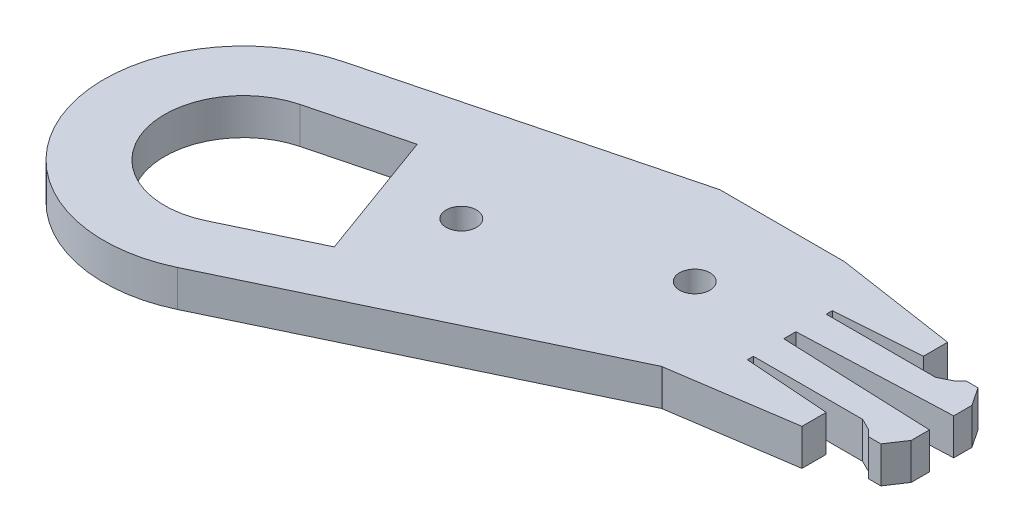
ISO-10303-21;
HEADER;
FILE_DESCRIPTION(('STEP AP214'),'2;1');
FILE_NAME('part.step','',(''),(''),'','','');
FILE_SCHEMA(('AUTOMOTIVE_DESIGN { 1 0 10303 214 1 1 1 1 }'));
ENDSEC;
DATA;
#1=APPLICATION_CONTEXT('core data for automotive mechanical design processes');
#2=APPLICATION_PROTOCOL_DEFINITION('international standard','automotive_design',2000,#1);
#3=PRODUCT_CONTEXT('',#1,'mechanical');
#4=PRODUCT('Part','Part','',(#3));
#5=PRODUCT_RELATED_PRODUCT_CATEGORY('part','',(#4));
#6=PRODUCT_DEFINITION_FORMATION('','',#4);
#7=PRODUCT_DEFINITION_CONTEXT('part definition',#1,'design');
#8=PRODUCT_DEFINITION('design','',#6,#7);
#9=PRODUCT_DEFINITION_SHAPE('','',#8);
#10=(LENGTH_UNIT() NAMED_UNIT(*) SI_UNIT(.MILLI.,.METRE.));
#11=(NAMED_UNIT(*) PLANE_ANGLE_UNIT() SI_UNIT($,.RADIAN.));
#12=(NAMED_UNIT(*) SI_UNIT($,.STERADIAN.) SOLID_ANGLE_UNIT());
#13=UNCERTAINTY_MEASURE_WITH_UNIT(LENGTH_MEASURE(1.E-05),#10,'distance_accuracy_value','');
#14=(GEOMETRIC_REPRESENTATION_CONTEXT(3) GLOBAL_UNCERTAINTY_ASSIGNED_CONTEXT((#13)) GLOBAL_UNIT_ASSIGNED_CONTEXT((#10,
#11,#12)) REPRESENTATION_CONTEXT('',''));
#15=CARTESIAN_POINT('',(0.,0.,0.));
#16=DIRECTION('',(0.,0.,1.));
#17=DIRECTION('',(1.,0.,0.));
#18=AXIS2_PLACEMENT_3D('',#15,#16,#17);
#19=CARTESIAN_POINT('',(-2.87937004662604,-3.,-11.1336978643482));
#20=DIRECTION('',(0.250380004054438,0.,0.968147640378109));
#21=DIRECTION('',(0.968147640378109,0.,-0.250380004054438));
#22=AXIS2_PLACEMENT_3D('',#19,#20,#21);
#23=PLANE('',#22);
#24=DIRECTION('',(0.968147640378109,0.,-0.250380004054438));
#25=VECTOR('',#24,1.);
#26=CARTESIAN_POINT('',(-2.87937004662604,0.,-11.1336978643482));
#27=LINE('',#26,#25);
#28=CARTESIAN_POINT('',(-2.87937004662604,0.,-11.1336978643482));
#29=VERTEX_POINT('',#28);
#30=CARTESIAN_POINT('',(21.7372937873807,0.,-17.5));
#31=VERTEX_POINT('',#30);
#32=EDGE_CURVE('E297',#29,#31,#27,.T.);
#33=ORIENTED_EDGE('',*,*,#32,.T.);
#34=DIRECTION('',(0.,1.,0.));
#35=VECTOR('',#34,1.);
#36=CARTESIAN_POINT('',(21.7372937873807,-3.,-17.5));
#37=LINE('',#36,#35);
#38=CARTESIAN_POINT('',(21.7372937873807,-3.,-17.5));
#39=VERTEX_POINT('',#38);
#40=EDGE_CURVE('E11',#39,#31,#37,.T.);
#41=ORIENTED_EDGE('',*,*,#40,.F.);
#42=DIRECTION('',(0.968147640378109,0.,-0.250380004054438));
#43=VECTOR('',#42,1.);
#44=CARTESIAN_POINT('',(-2.87937004662604,-3.,-11.1336978643482));
#45=LINE('',#44,#43);
#46=CARTESIAN_POINT('',(-2.87937004662604,-3.,-11.1336978643482));
#47=VERTEX_POINT('',#46);
#48=EDGE_CURVE('E54',#47,#39,#45,.T.);
#49=ORIENTED_EDGE('',*,*,#48,.F.);
#50=DIRECTION('',(0.,1.,0.));
#51=VECTOR('',#50,1.);
#52=CARTESIAN_POINT('',(-2.87937004662604,-3.,-11.1336978643482));
#53=LINE('',#52,#51);
#54=EDGE_CURVE('E432',#47,#29,#53,.T.);
#55=ORIENTED_EDGE('',*,*,#54,.T.);
#56=EDGE_LOOP('',(#33,#41,#49,#55));
#57=FACE_BOUND('',#56,.T.);
#58=ADVANCED_FACE('F35',(#57),#23,.F.);
#59=CARTESIAN_POINT('',(0.,-3.,-17.5));
#60=DIRECTION('',(0.,0.,-1.));
#61=DIRECTION('',(-1.,0.,0.));
#62=AXIS2_PLACEMENT_3D('',#59,#60,#61);
#63=PLANE('',#62);
#64=DIRECTION('',(-1.,0.,0.));
#65=VECTOR('',#64,1.);
#66=CARTESIAN_POINT('',(0.,0.,-17.5));
#67=LINE('',#66,#65);
#68=CARTESIAN_POINT('',(32.,0.,-17.5));
#69=VERTEX_POINT('',#68);
#70=EDGE_CURVE('E362',#69,#31,#67,.T.);
#71=ORIENTED_EDGE('',*,*,#70,.F.);
#72=DIRECTION('',(0.,1.,0.));
#73=VECTOR('',#72,1.);
#74=CARTESIAN_POINT('',(32.,-3.,-17.5));
#75=LINE('',#74,#73);
#76=CARTESIAN_POINT('',(32.,-3.,-17.5));
#77=VERTEX_POINT('',#76);
#78=EDGE_CURVE('E45',#77,#69,#75,.T.);
#79=ORIENTED_EDGE('',*,*,#78,.F.);
#80=DIRECTION('',(-1.,0.,0.));
#81=VECTOR('',#80,1.);
#82=CARTESIAN_POINT('',(0.,-3.,-17.5));
#83=LINE('',#82,#81);
#84=EDGE_CURVE('E270',#77,#39,#83,.T.);
#85=ORIENTED_EDGE('',*,*,#84,.T.);
#86=ORIENTED_EDGE('',*,*,#40,.T.);
#87=EDGE_LOOP('',(#71,#79,#85,#86));
#88=FACE_BOUND('',#87,.T.);
#89=ADVANCED_FACE('F621',(#88),#63,.T.);
#90=CARTESIAN_POINT('',(3.27139364303178,-3.,-21.8092909535452));
#91=DIRECTION('',(0.148340452930245,0.,-0.988936352868297));
#92=DIRECTION('',(-0.988936352868298,0.,-0.148340452930245));
#93=AXIS2_PLACEMENT_3D('',#90,#91,#92);
#94=PLANE('',#93);
#95=DIRECTION('',(-0.988936352868298,0.,-0.148340452930245));
#96=VECTOR('',#95,1.);
#97=CARTESIAN_POINT('',(3.27139364303178,0.,-21.8092909535452));
#98=LINE('',#97,#96);
#99=CARTESIAN_POINT('',(42.,0.,-16.));
#100=VERTEX_POINT('',#99);
#101=EDGE_CURVE('E257',#100,#69,#98,.T.);
#102=ORIENTED_EDGE('',*,*,#101,.F.);
#103=DIRECTION('',(0.,1.,0.));
#104=VECTOR('',#103,1.);
#105=CARTESIAN_POINT('',(42.,-3.,-16.));
#106=LINE('',#105,#104);
#107=CARTESIAN_POINT('',(42.,-3.,-16.));
#108=VERTEX_POINT('',#107);
#109=EDGE_CURVE('E253',#108,#100,#106,.T.);
#110=ORIENTED_EDGE('',*,*,#109,.F.);
#111=DIRECTION('',(-0.988936352868298,0.,-0.148340452930245));
#112=VECTOR('',#111,1.);
#113=CARTESIAN_POINT('',(3.27139364303178,-3.,-21.8092909535452));
#114=LINE('',#113,#112);
#115=EDGE_CURVE('E256',#108,#77,#114,.T.);
#116=ORIENTED_EDGE('',*,*,#115,.T.);
#117=ORIENTED_EDGE('',*,*,#78,.T.);
#118=EDGE_LOOP('',(#102,#110,#116,#117));
#119=FACE_BOUND('',#118,.T.);
#120=ADVANCED_FACE('F255',(#119),#94,.T.);
#121=CARTESIAN_POINT('',(42.,-3.,0.));
#122=DIRECTION('',(1.,0.,0.));
#123=DIRECTION('',(0.,0.,-1.));
#124=AXIS2_PLACEMENT_3D('',#121,#122,#123);
#125=PLANE('',#124);
#126=DIRECTION('',(0.,0.,-1.));
#127=VECTOR('',#126,1.);
#128=CARTESIAN_POINT('',(42.,0.,0.));
#129=LINE('',#128,#127);
#130=CARTESIAN_POINT('',(42.,0.,-14.));
#131=VERTEX_POINT('',#130);
#132=EDGE_CURVE('E359',#131,#100,#129,.T.);
#133=ORIENTED_EDGE('',*,*,#132,.F.);
#134=DIRECTION('',(0.,1.,0.));
#135=VECTOR('',#134,1.);
#136=CARTESIAN_POINT('',(42.,-3.,-14.));
#137=LINE('',#136,#135);
#138=CARTESIAN_POINT('',(42.,-3.,-14.));
#139=VERTEX_POINT('',#138);
#140=EDGE_CURVE('E262',#139,#131,#137,.T.);
#141=ORIENTED_EDGE('',*,*,#140,.F.);
#142=DIRECTION('',(0.,0.,-1.));
#143=VECTOR('',#142,1.);
#144=CARTESIAN_POINT('',(42.,-3.,0.));
#145=LINE('',#144,#143);
#146=EDGE_CURVE('E268',#139,#108,#145,.T.);
#147=ORIENTED_EDGE('',*,*,#146,.T.);
#148=ORIENTED_EDGE('',*,*,#109,.T.);
#149=EDGE_LOOP('',(#133,#141,#147,#148));
#150=FACE_BOUND('',#149,.T.);
#151=ADVANCED_FACE('F272',(#150),#125,.T.);
#152=CARTESIAN_POINT('',(-0.781725888324872,-3.,-10.9441624365482));
#153=DIRECTION('',(0.0712470499879095,0.,0.997458699830735));
#154=DIRECTION('',(0.997458699830735,0.,-0.0712470499879095));
#155=AXIS2_PLACEMENT_3D('',#152,#153,#154);
#156=PLANE('',#155);
#157=DIRECTION('',(0.997458699830735,0.,-0.0712470499879095));
#158=VECTOR('',#157,1.);
#159=CARTESIAN_POINT('',(-0.781725888324872,0.,-10.9441624365482));
#160=LINE('',#159,#158);
#161=CARTESIAN_POINT('',(35.,0.,-13.5));
#162=VERTEX_POINT('',#161);
#163=EDGE_CURVE('E356',#162,#131,#160,.T.);
#164=ORIENTED_EDGE('',*,*,#163,.F.);
#165=DIRECTION('',(0.,1.,0.));
#166=VECTOR('',#165,1.);
#167=CARTESIAN_POINT('',(35.,-3.,-13.5));
#168=LINE('',#167,#166);
#169=CARTESIAN_POINT('',(35.,-3.,-13.5));
#170=VERTEX_POINT('',#169);
#171=EDGE_CURVE('E374',#170,#162,#168,.T.);
#172=ORIENTED_EDGE('',*,*,#171,.F.);
#173=DIRECTION('',(0.997458699830735,0.,-0.0712470499879095));
#174=VECTOR('',#173,1.);
#175=CARTESIAN_POINT('',(-0.781725888324872,-3.,-10.9441624365482));
#176=LINE('',#175,#174);
#177=EDGE_CURVE('E273',#170,#139,#176,.T.);
#178=ORIENTED_EDGE('',*,*,#177,.T.);
#179=ORIENTED_EDGE('',*,*,#140,.T.);
#180=EDGE_LOOP('',(#164,#172,#178,#179));
#181=FACE_BOUND('',#180,.T.);
#182=ADVANCED_FACE('F624',(#181),#156,.T.);
#183=CARTESIAN_POINT('',(35.,-3.,0.));
#184=DIRECTION('',(1.,0.,0.));
#185=DIRECTION('',(0.,0.,-1.));
#186=AXIS2_PLACEMENT_3D('',#183,#184,#185);
#187=PLANE('',#186);
#188=DIRECTION('',(0.,0.,-1.));
#189=VECTOR('',#188,1.);
#190=CARTESIAN_POINT('',(35.,0.,0.));
#191=LINE('',#190,#189);
#192=CARTESIAN_POINT('',(35.,0.,-13.));
#193=VERTEX_POINT('',#192);
#194=EDGE_CURVE('E353',#193,#162,#191,.T.);
#195=ORIENTED_EDGE('',*,*,#194,.F.);
#196=DIRECTION('',(0.,1.,0.));
#197=VECTOR('',#196,1.);
#198=CARTESIAN_POINT('',(35.,-3.,-13.));
#199=LINE('',#198,#197);
#200=CARTESIAN_POINT('',(35.,-3.,-13.));
#201=VERTEX_POINT('',#200);
#202=EDGE_CURVE('E376',#201,#193,#199,.T.);
#203=ORIENTED_EDGE('',*,*,#202,.F.);
#204=DIRECTION('',(0.,0.,-1.));
#205=VECTOR('',#204,1.);
#206=CARTESIAN_POINT('',(35.,-3.,0.));
#207=LINE('',#206,#205);
#208=EDGE_CURVE('E275',#201,#170,#207,.T.);
#209=ORIENTED_EDGE('',*,*,#208,.T.);
#210=ORIENTED_EDGE('',*,*,#171,.T.);
#211=EDGE_LOOP('',(#195,#203,#209,#210));
#212=FACE_BOUND('',#211,.T.);
#213=ADVANCED_FACE('F518',(#212),#187,.T.);
#214=CARTESIAN_POINT('',(0.,-3.,-13.));
#215=DIRECTION('',(0.,0.,-1.));
#216=DIRECTION('',(-1.,0.,0.));
#217=AXIS2_PLACEMENT_3D('',#214,#215,#216);
#218=PLANE('',#217);
#219=DIRECTION('',(-1.,0.,0.));
#220=VECTOR('',#219,1.);
#221=CARTESIAN_POINT('',(0.,0.,-13.));
#222=LINE('',#221,#220);
#223=CARTESIAN_POINT('',(44.,0.,-13.));
#224=VERTEX_POINT('',#223);
#225=EDGE_CURVE('E350',#224,#193,#222,.T.);
#226=ORIENTED_EDGE('',*,*,#225,.F.);
#227=DIRECTION('',(0.,1.,0.));
#228=VECTOR('',#227,1.);
#229=CARTESIAN_POINT('',(44.,-3.,-13.));
#230=LINE('',#229,#228);
#231=CARTESIAN_POINT('',(44.,-3.,-13.));
#232=VERTEX_POINT('',#231);
#233=EDGE_CURVE('E378',#232,#224,#230,.T.);
#234=ORIENTED_EDGE('',*,*,#233,.F.);
#235=DIRECTION('',(-1.,0.,0.));
#236=VECTOR('',#235,1.);
#237=CARTESIAN_POINT('',(0.,-3.,-13.));
#238=LINE('',#237,#236);
#239=EDGE_CURVE('E512',#232,#201,#238,.T.);
#240=ORIENTED_EDGE('',*,*,#239,.T.);
#241=ORIENTED_EDGE('',*,*,#202,.T.);
#242=EDGE_LOOP('',(#226,#234,#240,#241));
#243=FACE_BOUND('',#242,.T.);
#244=ADVANCED_FACE('F524',(#243),#218,.T.);
#245=CARTESIAN_POINT('',(3.6,-3.,7.2));
#246=DIRECTION('',(-0.447213595499958,0.,-0.894427190999916));
#247=DIRECTION('',(-0.894427190999916,0.,0.447213595499958));
#248=AXIS2_PLACEMENT_3D('',#245,#246,#247);
#249=PLANE('',#248);
#250=DIRECTION('',(-0.894427190999916,0.,0.447213595499958));
#251=VECTOR('',#250,1.);
#252=CARTESIAN_POINT('',(3.6,0.,7.2));
#253=LINE('',#252,#251);
#254=CARTESIAN_POINT('',(45.,0.,-13.5));
#255=VERTEX_POINT('',#254);
#256=EDGE_CURVE('E347',#255,#224,#253,.T.);
#257=ORIENTED_EDGE('',*,*,#256,.F.);
#258=DIRECTION('',(0.,1.,0.));
#259=VECTOR('',#258,1.);
#260=CARTESIAN_POINT('',(45.,-3.,-13.5));
#261=LINE('',#260,#259);
#262=CARTESIAN_POINT('',(45.,-3.,-13.5));
#263=VERTEX_POINT('',#262);
#264=EDGE_CURVE('E380',#263,#255,#261,.T.);
#265=ORIENTED_EDGE('',*,*,#264,.F.);
#266=DIRECTION('',(-0.894427190999916,0.,0.447213595499958));
#267=VECTOR('',#266,1.);
#268=CARTESIAN_POINT('',(3.6,-3.,7.2));
#269=LINE('',#268,#267);
#270=EDGE_CURVE('E509',#263,#232,#269,.T.);
#271=ORIENTED_EDGE('',*,*,#270,.T.);
#272=ORIENTED_EDGE('',*,*,#233,.T.);
#273=EDGE_LOOP('',(#257,#265,#271,#272));
#274=FACE_BOUND('',#273,.T.);
#275=ADVANCED_FACE('F527',(#274),#249,.T.);
#276=CARTESIAN_POINT('',(15.75,-3.,15.75));
#277=DIRECTION('',(-0.707106781186547,0.,-0.707106781186547));
#278=DIRECTION('',(-0.707106781186548,0.,0.707106781186548));
#279=AXIS2_PLACEMENT_3D('',#276,#277,#278);
#280=PLANE('',#279);
#281=DIRECTION('',(-0.707106781186548,0.,0.707106781186548));
#282=VECTOR('',#281,1.);
#283=CARTESIAN_POINT('',(15.75,0.,15.75));
#284=LINE('',#283,#282);
#285=CARTESIAN_POINT('',(45.5,0.,-14.));
#286=VERTEX_POINT('',#285);
#287=EDGE_CURVE('E344',#286,#255,#284,.T.);
#288=ORIENTED_EDGE('',*,*,#287,.F.);
#289=DIRECTION('',(0.,1.,0.));
#290=VECTOR('',#289,1.);
#291=CARTESIAN_POINT('',(45.5,-3.,-14.));
#292=LINE('',#291,#290);
#293=CARTESIAN_POINT('',(45.5,-3.,-14.));
#294=VERTEX_POINT('',#293);
#295=EDGE_CURVE('E382',#294,#286,#292,.T.);
#296=ORIENTED_EDGE('',*,*,#295,.F.);
#297=DIRECTION('',(-0.707106781186548,0.,0.707106781186548));
#298=VECTOR('',#297,1.);
#299=CARTESIAN_POINT('',(15.75,-3.,15.75));
#300=LINE('',#299,#298);
#301=EDGE_CURVE('E506',#294,#263,#300,.T.);
#302=ORIENTED_EDGE('',*,*,#301,.T.);
#303=ORIENTED_EDGE('',*,*,#264,.T.);
#304=EDGE_LOOP('',(#288,#296,#302,#303));
#305=FACE_BOUND('',#304,.T.);
#306=ADVANCED_FACE('F532',(#305),#280,.T.);
#307=CARTESIAN_POINT('',(0.,-3.,-14.));
#308=DIRECTION('',(0.,0.,-1.));
#309=DIRECTION('',(-1.,0.,0.));
#310=AXIS2_PLACEMENT_3D('',#307,#308,#309);
#311=PLANE('',#310);
#312=DIRECTION('',(-1.,0.,0.));
#313=VECTOR('',#312,1.);
#314=CARTESIAN_POINT('',(0.,0.,-14.));
#315=LINE('',#314,#313);
#316=CARTESIAN_POINT('',(46.5,0.,-14.));
#317=VERTEX_POINT('',#316);
#318=EDGE_CURVE('E341',#317,#286,#315,.T.);
#319=ORIENTED_EDGE('',*,*,#318,.F.);
#320=DIRECTION('',(0.,1.,0.));
#321=VECTOR('',#320,1.);
#322=CARTESIAN_POINT('',(46.5,-3.,-14.));
#323=LINE('',#322,#321);
#324=CARTESIAN_POINT('',(46.5,-3.,-14.));
#325=VERTEX_POINT('',#324);
#326=EDGE_CURVE('E384',#325,#317,#323,.T.);
#327=ORIENTED_EDGE('',*,*,#326,.F.);
#328=DIRECTION('',(-1.,0.,0.));
#329=VECTOR('',#328,1.);
#330=CARTESIAN_POINT('',(0.,-3.,-14.));
#331=LINE('',#330,#329);
#332=EDGE_CURVE('E503',#325,#294,#331,.T.);
#333=ORIENTED_EDGE('',*,*,#332,.T.);
#334=ORIENTED_EDGE('',*,*,#295,.T.);
#335=EDGE_LOOP('',(#319,#327,#333,#334));
#336=FACE_BOUND('',#335,.T.);
#337=ADVANCED_FACE('F535',(#336),#311,.T.);
#338=CARTESIAN_POINT('',(38.6538461538461,-3.,-25.7692307692308));
#339=DIRECTION('',(0.832050294337843,0.,-0.554700196225229));
#340=DIRECTION('',(-0.55470019622523,0.,-0.832050294337843));
#341=AXIS2_PLACEMENT_3D('',#338,#339,#340);
#342=PLANE('',#341);
#343=DIRECTION('',(-0.55470019622523,0.,-0.832050294337843));
#344=VECTOR('',#343,1.);
#345=CARTESIAN_POINT('',(38.6538461538461,0.,-25.7692307692308));
#346=LINE('',#345,#344);
#347=CARTESIAN_POINT('',(47.5,0.,-12.5));
#348=VERTEX_POINT('',#347);
#349=EDGE_CURVE('E338',#348,#317,#346,.T.);
#350=ORIENTED_EDGE('',*,*,#349,.F.);
#351=DIRECTION('',(0.,1.,0.));
#352=VECTOR('',#351,1.);
#353=CARTESIAN_POINT('',(47.5,-3.,-12.5));
#354=LINE('',#353,#352);
#355=CARTESIAN_POINT('',(47.5,-3.,-12.5));
#356=VERTEX_POINT('',#355);
#357=EDGE_CURVE('E386',#356,#348,#354,.T.);
#358=ORIENTED_EDGE('',*,*,#357,.F.);
#359=DIRECTION('',(-0.55470019622523,0.,-0.832050294337843));
#360=VECTOR('',#359,1.);
#361=CARTESIAN_POINT('',(38.6538461538461,-3.,-25.7692307692308));
#362=LINE('',#361,#360);
#363=EDGE_CURVE('E500',#356,#325,#362,.T.);
#364=ORIENTED_EDGE('',*,*,#363,.T.);
#365=ORIENTED_EDGE('',*,*,#326,.T.);
#366=EDGE_LOOP('',(#350,#358,#364,#365));
#367=FACE_BOUND('',#366,.T.);
#368=ADVANCED_FACE('F540',(#367),#342,.T.);
#369=CARTESIAN_POINT('',(47.5,-3.,0.));
#370=DIRECTION('',(1.,0.,0.));
#371=DIRECTION('',(0.,0.,-1.));
#372=AXIS2_PLACEMENT_3D('',#369,#370,#371);
#373=PLANE('',#372);
#374=DIRECTION('',(0.,0.,-1.));
#375=VECTOR('',#374,1.);
#376=CARTESIAN_POINT('',(47.5,0.,0.));
#377=LINE('',#376,#375);
#378=CARTESIAN_POINT('',(47.5,0.,-11.));
#379=VERTEX_POINT('',#378);
#380=EDGE_CURVE('E335',#379,#348,#377,.T.);
#381=ORIENTED_EDGE('',*,*,#380,.F.);
#382=DIRECTION('',(0.,1.,0.));
#383=VECTOR('',#382,1.);
#384=CARTESIAN_POINT('',(47.5,-3.,-11.));
#385=LINE('',#384,#383);
#386=CARTESIAN_POINT('',(47.5,-3.,-11.));
#387=VERTEX_POINT('',#386);
#388=EDGE_CURVE('E388',#387,#379,#385,.T.);
#389=ORIENTED_EDGE('',*,*,#388,.F.);
#390=DIRECTION('',(0.,0.,-1.));
#391=VECTOR('',#390,1.);
#392=CARTESIAN_POINT('',(47.5,-3.,0.));
#393=LINE('',#392,#391);
#394=EDGE_CURVE('E497',#387,#356,#393,.T.);
#395=ORIENTED_EDGE('',*,*,#394,.T.);
#396=ORIENTED_EDGE('',*,*,#357,.T.);
#397=EDGE_LOOP('',(#381,#389,#395,#396));
#398=FACE_BOUND('',#397,.T.);
#399=ADVANCED_FACE('F543',(#398),#373,.T.);
#400=CARTESIAN_POINT('',(-0.363418530351438,-3.,-9.08546325878594));
#401=DIRECTION('',(0.0399680383488716,0.,0.999200958721789));
#402=DIRECTION('',(0.99920095872179,0.,-0.0399680383488716));
#403=AXIS2_PLACEMENT_3D('',#400,#401,#402);
#404=PLANE('',#403);
#405=DIRECTION('',(0.99920095872179,0.,-0.0399680383488716));
#406=VECTOR('',#405,1.);
#407=CARTESIAN_POINT('',(-0.363418530351438,0.,-9.08546325878594));
#408=LINE('',#407,#406);
#409=CARTESIAN_POINT('',(35.,0.,-10.5));
#410=VERTEX_POINT('',#409);
#411=EDGE_CURVE('E332',#410,#379,#408,.T.);
#412=ORIENTED_EDGE('',*,*,#411,.F.);
#413=DIRECTION('',(0.,1.,0.));
#414=VECTOR('',#413,1.);
#415=CARTESIAN_POINT('',(35.,-3.,-10.5));
#416=LINE('',#415,#414);
#417=CARTESIAN_POINT('',(35.,-3.,-10.5));
#418=VERTEX_POINT('',#417);
#419=EDGE_CURVE('E390',#418,#410,#416,.T.);
#420=ORIENTED_EDGE('',*,*,#419,.F.);
#421=DIRECTION('',(0.99920095872179,0.,-0.0399680383488716));
#422=VECTOR('',#421,1.);
#423=CARTESIAN_POINT('',(-0.363418530351438,-3.,-9.08546325878594));
#424=LINE('',#423,#422);
#425=EDGE_CURVE('E494',#418,#387,#424,.T.);
#426=ORIENTED_EDGE('',*,*,#425,.T.);
#427=ORIENTED_EDGE('',*,*,#388,.T.);
#428=EDGE_LOOP('',(#412,#420,#426,#427));
#429=FACE_BOUND('',#428,.T.);
#430=ADVANCED_FACE('F547',(#429),#404,.T.);
#431=CARTESIAN_POINT('',(35.,-3.,0.));
#432=DIRECTION('',(-1.,0.,0.));
#433=DIRECTION('',(0.,0.,1.));
#434=AXIS2_PLACEMENT_3D('',#431,#432,#433);
#435=PLANE('',#434);
#436=DIRECTION('',(0.,0.,1.));
#437=VECTOR('',#436,1.);
#438=CARTESIAN_POINT('',(35.,0.,0.));
#439=LINE('',#438,#437);
#440=CARTESIAN_POINT('',(35.,0.,-9.5));
#441=VERTEX_POINT('',#440);
#442=EDGE_CURVE('E330',#410,#441,#439,.T.);
#443=ORIENTED_EDGE('',*,*,#442,.T.);
#444=DIRECTION('',(0.,1.,0.));
#445=VECTOR('',#444,1.);
#446=CARTESIAN_POINT('',(35.,-3.,-9.5));
#447=LINE('',#446,#445);
#448=CARTESIAN_POINT('',(35.,-3.,-9.5));
#449=VERTEX_POINT('',#448);
#450=EDGE_CURVE('E392',#449,#441,#447,.T.);
#451=ORIENTED_EDGE('',*,*,#450,.F.);
#452=DIRECTION('',(0.,0.,1.));
#453=VECTOR('',#452,1.);
#454=CARTESIAN_POINT('',(35.,-3.,0.));
#455=LINE('',#454,#453);
#456=EDGE_CURVE('E492',#418,#449,#455,.T.);
#457=ORIENTED_EDGE('',*,*,#456,.F.);
#458=ORIENTED_EDGE('',*,*,#419,.T.);
#459=EDGE_LOOP('',(#443,#451,#457,#458));
#460=FACE_BOUND('',#459,.T.);
#461=ADVANCED_FACE('F552',(#460),#435,.F.);
#462=CARTESIAN_POINT('',(0.435303514376997,-3.,-10.8825878594249));
#463=DIRECTION('',(-0.0399680383488716,0.,0.999200958721789));
#464=DIRECTION('',(0.99920095872179,0.,0.0399680383488716));
#465=AXIS2_PLACEMENT_3D('',#462,#463,#464);
#466=PLANE('',#465);
#467=DIRECTION('',(0.99920095872179,0.,0.0399680383488716));
#468=VECTOR('',#467,1.);
#469=CARTESIAN_POINT('',(0.435303514376997,0.,-10.8825878594249));
#470=LINE('',#469,#468);
#471=CARTESIAN_POINT('',(47.5,0.,-9.));
#472=VERTEX_POINT('',#471);
#473=EDGE_CURVE('E328',#441,#472,#470,.T.);
#474=ORIENTED_EDGE('',*,*,#473,.T.);
#475=DIRECTION('',(0.,1.,0.));
#476=VECTOR('',#475,1.);
#477=CARTESIAN_POINT('',(47.5,-3.,-9.));
#478=LINE('',#477,#476);
#479=CARTESIAN_POINT('',(47.5,-3.,-9.));
#480=VERTEX_POINT('',#479);
#481=EDGE_CURVE('E395',#480,#472,#478,.T.);
#482=ORIENTED_EDGE('',*,*,#481,.F.);
#483=DIRECTION('',(0.99920095872179,0.,0.0399680383488716));
#484=VECTOR('',#483,1.);
#485=CARTESIAN_POINT('',(0.435303514376997,-3.,-10.8825878594249));
#486=LINE('',#485,#484);
#487=EDGE_CURVE('E490',#449,#480,#486,.T.);
#488=ORIENTED_EDGE('',*,*,#487,.F.);
#489=ORIENTED_EDGE('',*,*,#450,.T.);
#490=EDGE_LOOP('',(#474,#482,#488,#489));
#491=FACE_BOUND('',#490,.T.);
#492=ADVANCED_FACE('F558',(#491),#466,.F.);
#493=CARTESIAN_POINT('',(47.5,-3.,0.));
#494=DIRECTION('',(-1.,0.,0.));
#495=DIRECTION('',(0.,0.,1.));
#496=AXIS2_PLACEMENT_3D('',#493,#494,#495);
#497=PLANE('',#496);
#498=DIRECTION('',(0.,0.,1.));
#499=VECTOR('',#498,1.);
#500=CARTESIAN_POINT('',(47.5,0.,0.));
#501=LINE('',#500,#499);
#502=CARTESIAN_POINT('',(47.5,0.,-7.5));
#503=VERTEX_POINT('',#502);
#504=EDGE_CURVE('E326',#472,#503,#501,.T.);
#505=ORIENTED_EDGE('',*,*,#504,.T.);
#506=DIRECTION('',(0.,1.,0.));
#507=VECTOR('',#506,1.);
#508=CARTESIAN_POINT('',(47.5,-3.,-7.5));
#509=LINE('',#508,#507);
#510=CARTESIAN_POINT('',(47.5,-3.,-7.5));
#511=VERTEX_POINT('',#510);
#512=EDGE_CURVE('E398',#511,#503,#509,.T.);
#513=ORIENTED_EDGE('',*,*,#512,.F.);
#514=DIRECTION('',(0.,0.,1.));
#515=VECTOR('',#514,1.);
#516=CARTESIAN_POINT('',(47.5,-3.,0.));
#517=LINE('',#516,#515);
#518=EDGE_CURVE('E488',#480,#511,#517,.T.);
#519=ORIENTED_EDGE('',*,*,#518,.F.);
#520=ORIENTED_EDGE('',*,*,#481,.T.);
#521=EDGE_LOOP('',(#505,#513,#519,#520));
#522=FACE_BOUND('',#521,.T.);
#523=ADVANCED_FACE('F562',(#522),#497,.F.);
#524=CARTESIAN_POINT('',(29.4230769230769,-3.,19.6153846153846));
#525=DIRECTION('',(-0.832050294337843,0.,-0.554700196225229));
#526=DIRECTION('',(-0.554700196225229,0.,0.832050294337844));
#527=AXIS2_PLACEMENT_3D('',#524,#525,#526);
#528=PLANE('',#527);
#529=DIRECTION('',(-0.554700196225229,0.,0.832050294337844));
#530=VECTOR('',#529,1.);
#531=CARTESIAN_POINT('',(29.4230769230769,0.,19.6153846153846));
#532=LINE('',#531,#530);
#533=CARTESIAN_POINT('',(46.5,0.,-6.));
#534=VERTEX_POINT('',#533);
#535=EDGE_CURVE('E324',#503,#534,#532,.T.);
#536=ORIENTED_EDGE('',*,*,#535,.T.);
#537=DIRECTION('',(0.,1.,0.));
#538=VECTOR('',#537,1.);
#539=CARTESIAN_POINT('',(46.5,-3.,-6.));
#540=LINE('',#539,#538);
#541=CARTESIAN_POINT('',(46.5,-3.,-6.));
#542=VERTEX_POINT('',#541);
#543=EDGE_CURVE('E401',#542,#534,#540,.T.);
#544=ORIENTED_EDGE('',*,*,#543,.F.);
#545=DIRECTION('',(-0.554700196225229,0.,0.832050294337844));
#546=VECTOR('',#545,1.);
#547=CARTESIAN_POINT('',(29.4230769230769,-3.,19.6153846153846));
#548=LINE('',#547,#546);
#549=EDGE_CURVE('E486',#511,#542,#548,.T.);
#550=ORIENTED_EDGE('',*,*,#549,.F.);
#551=ORIENTED_EDGE('',*,*,#512,.T.);
#552=EDGE_LOOP('',(#536,#544,#550,#551));
#553=FACE_BOUND('',#552,.T.);
#554=ADVANCED_FACE('F567',(#553),#528,.F.);
#555=CARTESIAN_POINT('',(0.,-3.,-6.00000000000004));
#556=DIRECTION('',(0.,0.,-1.));
#557=DIRECTION('',(-1.,0.,0.));
#558=AXIS2_PLACEMENT_3D('',#555,#556,#557);
#559=PLANE('',#558);
#560=DIRECTION('',(-1.,0.,0.));
#561=VECTOR('',#560,1.);
#562=CARTESIAN_POINT('',(0.,0.,-6.00000000000004));
#563=LINE('',#562,#561);
#564=CARTESIAN_POINT('',(45.5,0.,-6.));
#565=VERTEX_POINT('',#564);
#566=EDGE_CURVE('E322',#534,#565,#563,.T.);
#567=ORIENTED_EDGE('',*,*,#566,.T.);
#568=DIRECTION('',(0.,1.,0.));
#569=VECTOR('',#568,1.);
#570=CARTESIAN_POINT('',(45.5,-3.,-6.));
#571=LINE('',#570,#569);
#572=CARTESIAN_POINT('',(45.5,-3.,-6.));
#573=VERTEX_POINT('',#572);
#574=EDGE_CURVE('E404',#573,#565,#571,.T.);
#575=ORIENTED_EDGE('',*,*,#574,.F.);
#576=DIRECTION('',(-1.,0.,0.));
#577=VECTOR('',#576,1.);
#578=CARTESIAN_POINT('',(0.,-3.,-6.00000000000004));
#579=LINE('',#578,#577);
#580=EDGE_CURVE('E484',#542,#573,#579,.T.);
#581=ORIENTED_EDGE('',*,*,#580,.F.);
#582=ORIENTED_EDGE('',*,*,#543,.T.);
#583=EDGE_LOOP('',(#567,#575,#581,#582));
#584=FACE_BOUND('',#583,.T.);
#585=ADVANCED_FACE('F573',(#584),#559,.F.);
#586=CARTESIAN_POINT('',(25.75,-3.,-25.75));
#587=DIRECTION('',(0.707106781186547,0.,-0.707106781186547));
#588=DIRECTION('',(-0.707106781186548,0.,-0.707106781186548));
#589=AXIS2_PLACEMENT_3D('',#586,#587,#588);
#590=PLANE('',#589);
#591=DIRECTION('',(-0.707106781186548,0.,-0.707106781186548));
#592=VECTOR('',#591,1.);
#593=CARTESIAN_POINT('',(25.75,0.,-25.75));
#594=LINE('',#593,#592);
#595=CARTESIAN_POINT('',(45.,0.,-6.5));
#596=VERTEX_POINT('',#595);
#597=EDGE_CURVE('E320',#565,#596,#594,.T.);
#598=ORIENTED_EDGE('',*,*,#597,.T.);
#599=DIRECTION('',(0.,1.,0.));
#600=VECTOR('',#599,1.);
#601=CARTESIAN_POINT('',(45.,-3.,-6.5));
#602=LINE('',#601,#600);
#603=CARTESIAN_POINT('',(45.,-3.,-6.5));
#604=VERTEX_POINT('',#603);
#605=EDGE_CURVE('E407',#604,#596,#602,.T.);
#606=ORIENTED_EDGE('',*,*,#605,.F.);
#607=DIRECTION('',(-0.707106781186548,0.,-0.707106781186548));
#608=VECTOR('',#607,1.);
#609=CARTESIAN_POINT('',(25.75,-3.,-25.75));
#610=LINE('',#609,#608);
#611=EDGE_CURVE('E482',#573,#604,#610,.T.);
#612=ORIENTED_EDGE('',*,*,#611,.F.);
#613=ORIENTED_EDGE('',*,*,#574,.T.);
#614=EDGE_LOOP('',(#598,#606,#612,#613));
#615=FACE_BOUND('',#614,.T.);
#616=ADVANCED_FACE('F577',(#615),#590,.F.);
#617=CARTESIAN_POINT('',(11.6,-3.,-23.2));
#618=DIRECTION('',(0.447213595499957,0.,-0.894427190999916));
#619=DIRECTION('',(-0.894427190999916,0.,-0.447213595499957));
#620=AXIS2_PLACEMENT_3D('',#617,#618,#619);
#621=PLANE('',#620);
#622=DIRECTION('',(-0.894427190999916,0.,-0.447213595499957));
#623=VECTOR('',#622,1.);
#624=CARTESIAN_POINT('',(11.6,0.,-23.2));
#625=LINE('',#624,#623);
#626=CARTESIAN_POINT('',(44.,0.,-7.));
#627=VERTEX_POINT('',#626);
#628=EDGE_CURVE('E318',#596,#627,#625,.T.);
#629=ORIENTED_EDGE('',*,*,#628,.T.);
#630=DIRECTION('',(0.,1.,0.));
#631=VECTOR('',#630,1.);
#632=CARTESIAN_POINT('',(44.,-3.,-7.));
#633=LINE('',#632,#631);
#634=CARTESIAN_POINT('',(44.,-3.,-7.));
#635=VERTEX_POINT('',#634);
#636=EDGE_CURVE('E410',#635,#627,#633,.T.);
#637=ORIENTED_EDGE('',*,*,#636,.F.);
#638=DIRECTION('',(-0.894427190999916,0.,-0.447213595499957));
#639=VECTOR('',#638,1.);
#640=CARTESIAN_POINT('',(11.6,-3.,-23.2));
#641=LINE('',#640,#639);
#642=EDGE_CURVE('E480',#604,#635,#641,.T.);
#643=ORIENTED_EDGE('',*,*,#642,.F.);
#644=ORIENTED_EDGE('',*,*,#605,.T.);
#645=EDGE_LOOP('',(#629,#637,#643,#644));
#646=FACE_BOUND('',#645,.T.);
#647=ADVANCED_FACE('F582',(#646),#621,.F.);
#648=CARTESIAN_POINT('',(0.,-3.,-7.));
#649=DIRECTION('',(0.,0.,-1.));
#650=DIRECTION('',(-1.,0.,0.));
#651=AXIS2_PLACEMENT_3D('',#648,#649,#650);
#652=PLANE('',#651);
#653=DIRECTION('',(-1.,0.,0.));
#654=VECTOR('',#653,1.);
#655=CARTESIAN_POINT('',(0.,0.,-7.));
#656=LINE('',#655,#654);
#657=CARTESIAN_POINT('',(35.,0.,-7.));
#658=VERTEX_POINT('',#657);
#659=EDGE_CURVE('E316',#627,#658,#656,.T.);
#660=ORIENTED_EDGE('',*,*,#659,.T.);
#661=DIRECTION('',(0.,1.,0.));
#662=VECTOR('',#661,1.);
#663=CARTESIAN_POINT('',(35.,-3.,-7.));
#664=LINE('',#663,#662);
#665=CARTESIAN_POINT('',(35.,-3.,-7.));
#666=VERTEX_POINT('',#665);
#667=EDGE_CURVE('E413',#666,#658,#664,.T.);
#668=ORIENTED_EDGE('',*,*,#667,.F.);
#669=DIRECTION('',(-1.,0.,0.));
#670=VECTOR('',#669,1.);
#671=CARTESIAN_POINT('',(0.,-3.,-7.));
#672=LINE('',#671,#670);
#673=EDGE_CURVE('E478',#635,#666,#672,.T.);
#674=ORIENTED_EDGE('',*,*,#673,.F.);
#675=ORIENTED_EDGE('',*,*,#636,.T.);
#676=EDGE_LOOP('',(#660,#668,#674,#675));
#677=FACE_BOUND('',#676,.T.);
#678=ADVANCED_FACE('F588',(#677),#652,.F.);
#679=CARTESIAN_POINT('',(35.,-3.,0.));
#680=DIRECTION('',(-1.,0.,0.));
#681=DIRECTION('',(0.,0.,1.));
#682=AXIS2_PLACEMENT_3D('',#679,#680,#681);
#683=PLANE('',#682);
#684=DIRECTION('',(0.,0.,1.));
#685=VECTOR('',#684,1.);
#686=CARTESIAN_POINT('',(35.,0.,0.));
#687=LINE('',#686,#685);
#688=CARTESIAN_POINT('',(35.,0.,-6.5));
#689=VERTEX_POINT('',#688);
#690=EDGE_CURVE('E314',#658,#689,#687,.T.);
#691=ORIENTED_EDGE('',*,*,#690,.T.);
#692=DIRECTION('',(0.,1.,0.));
#693=VECTOR('',#692,1.);
#694=CARTESIAN_POINT('',(35.,-3.,-6.5));
#695=LINE('',#694,#693);
#696=CARTESIAN_POINT('',(35.,-3.,-6.5));
#697=VERTEX_POINT('',#696);
#698=EDGE_CURVE('E416',#697,#689,#695,.T.);
#699=ORIENTED_EDGE('',*,*,#698,.F.);
#700=DIRECTION('',(0.,0.,1.));
#701=VECTOR('',#700,1.);
#702=CARTESIAN_POINT('',(35.,-3.,0.));
#703=LINE('',#702,#701);
#704=EDGE_CURVE('E476',#666,#697,#703,.T.);
#705=ORIENTED_EDGE('',*,*,#704,.F.);
#706=ORIENTED_EDGE('',*,*,#667,.T.);
#707=EDGE_LOOP('',(#691,#699,#705,#706));
#708=FACE_BOUND('',#707,.T.);
#709=ADVANCED_FACE('F592',(#708),#683,.F.);
#710=CARTESIAN_POINT('',(0.639593908629442,-3.,-8.95431472081218));
#711=DIRECTION('',(-0.0712470499879097,0.,0.997458699830735));
#712=DIRECTION('',(0.997458699830735,0.,0.0712470499879097));
#713=AXIS2_PLACEMENT_3D('',#710,#711,#712);
#714=PLANE('',#713);
#715=DIRECTION('',(0.997458699830735,0.,0.0712470499879097));
#716=VECTOR('',#715,1.);
#717=CARTESIAN_POINT('',(0.639593908629442,0.,-8.95431472081218));
#718=LINE('',#717,#716);
#719=CARTESIAN_POINT('',(42.,0.,-6.));
#720=VERTEX_POINT('',#719);
#721=EDGE_CURVE('E312',#689,#720,#718,.T.);
#722=ORIENTED_EDGE('',*,*,#721,.T.);
#723=DIRECTION('',(0.,1.,0.));
#724=VECTOR('',#723,1.);
#725=CARTESIAN_POINT('',(42.,-3.,-6.));
#726=LINE('',#725,#724);
#727=CARTESIAN_POINT('',(42.,-3.,-6.));
#728=VERTEX_POINT('',#727);
#729=EDGE_CURVE('E419',#728,#720,#726,.T.);
#730=ORIENTED_EDGE('',*,*,#729,.F.);
#731=DIRECTION('',(0.997458699830735,0.,0.0712470499879097));
#732=VECTOR('',#731,1.);
#733=CARTESIAN_POINT('',(0.639593908629442,-3.,-8.95431472081218));
#734=LINE('',#733,#732);
#735=EDGE_CURVE('E474',#697,#728,#734,.T.);
#736=ORIENTED_EDGE('',*,*,#735,.F.);
#737=ORIENTED_EDGE('',*,*,#698,.T.);
#738=EDGE_LOOP('',(#722,#730,#736,#737));
#739=FACE_BOUND('',#738,.T.);
#740=ADVANCED_FACE('F597',(#739),#714,.F.);
#741=CARTESIAN_POINT('',(42.,-3.,0.));
#742=DIRECTION('',(-1.,0.,0.));
#743=DIRECTION('',(0.,0.,1.));
#744=AXIS2_PLACEMENT_3D('',#741,#742,#743);
#745=PLANE('',#744);
#746=DIRECTION('',(0.,0.,1.));
#747=VECTOR('',#746,1.);
#748=CARTESIAN_POINT('',(42.,0.,0.));
#749=LINE('',#748,#747);
#750=CARTESIAN_POINT('',(42.,0.,-4.));
#751=VERTEX_POINT('',#750);
#752=EDGE_CURVE('E310',#720,#751,#749,.T.);
#753=ORIENTED_EDGE('',*,*,#752,.T.);
#754=DIRECTION('',(0.,1.,0.));
#755=VECTOR('',#754,1.);
#756=CARTESIAN_POINT('',(42.,-3.,-4.));
#757=LINE('',#756,#755);
#758=CARTESIAN_POINT('',(42.,-3.,-4.));
#759=VERTEX_POINT('',#758);
#760=EDGE_CURVE('E422',#759,#751,#757,.T.);
#761=ORIENTED_EDGE('',*,*,#760,.F.);
#762=DIRECTION('',(0.,0.,1.));
#763=VECTOR('',#762,1.);
#764=CARTESIAN_POINT('',(42.,-3.,0.));
#765=LINE('',#764,#763);
#766=EDGE_CURVE('E472',#728,#759,#765,.T.);
#767=ORIENTED_EDGE('',*,*,#766,.F.);
#768=ORIENTED_EDGE('',*,*,#729,.T.);
#769=EDGE_LOOP('',(#753,#761,#767,#768));
#770=FACE_BOUND('',#769,.T.);
#771=ADVANCED_FACE('F603',(#770),#745,.F.);
#772=CARTESIAN_POINT('',(0.337408312958435,-3.,2.24938875305624));
#773=DIRECTION('',(-0.148340452930245,0.,-0.988936352868297));
#774=DIRECTION('',(-0.988936352868298,0.,0.148340452930245));
#775=AXIS2_PLACEMENT_3D('',#772,#773,#774);
#776=PLANE('',#775);
#777=DIRECTION('',(-0.988936352868298,0.,0.148340452930245));
#778=VECTOR('',#777,1.);
#779=CARTESIAN_POINT('',(0.337408312958435,0.,2.24938875305624));
#780=LINE('',#779,#778);
#781=CARTESIAN_POINT('',(32.,0.,-2.5));
#782=VERTEX_POINT('',#781);
#783=EDGE_CURVE('E308',#751,#782,#780,.T.);
#784=ORIENTED_EDGE('',*,*,#783,.T.);
#785=DIRECTION('',(0.,1.,0.));
#786=VECTOR('',#785,1.);
#787=CARTESIAN_POINT('',(32.,-3.,-2.5));
#788=LINE('',#787,#786);
#789=CARTESIAN_POINT('',(32.,-3.,-2.5));
#790=VERTEX_POINT('',#789);
#791=EDGE_CURVE('E425',#790,#782,#788,.T.);
#792=ORIENTED_EDGE('',*,*,#791,.F.);
#793=DIRECTION('',(-0.988936352868298,0.,0.148340452930245));
#794=VECTOR('',#793,1.);
#795=CARTESIAN_POINT('',(0.337408312958435,-3.,2.24938875305624));
#796=LINE('',#795,#794);
#797=EDGE_CURVE('E470',#759,#790,#796,.T.);
#798=ORIENTED_EDGE('',*,*,#797,.F.);
#799=ORIENTED_EDGE('',*,*,#760,.T.);
#800=EDGE_LOOP('',(#784,#792,#798,#799));
#801=FACE_BOUND('',#800,.T.);
#802=ADVANCED_FACE('F607',(#801),#776,.F.);
#803=CARTESIAN_POINT('',(2.11184067148274E-13,-3.,-2.50000000000271));
#804=DIRECTION('',(0.,0.,-1.));
#805=DIRECTION('',(-1.,0.,0.));
#806=AXIS2_PLACEMENT_3D('',#803,#804,#805);
#807=PLANE('',#806);
#808=DIRECTION('',(-1.,0.,0.));
#809=VECTOR('',#808,1.);
#810=CARTESIAN_POINT('',(2.11184067148274E-13,0.,-2.50000000000271));
#811=LINE('',#810,#809);
#812=CARTESIAN_POINT('',(31.9537947171671,0.,-2.50000000000001));
#813=VERTEX_POINT('',#812);
#814=EDGE_CURVE('E305',#782,#813,#811,.T.);
#815=ORIENTED_EDGE('',*,*,#814,.T.);
#816=DIRECTION('',(0.,1.,0.));
#817=VECTOR('',#816,1.);
#818=CARTESIAN_POINT('',(31.9537947171671,-3.,-2.50000000000001));
#819=LINE('',#818,#817);
#820=CARTESIAN_POINT('',(31.9537947171671,-3.,-2.50000000000001));
#821=VERTEX_POINT('',#820);
#822=EDGE_CURVE('E428',#821,#813,#819,.T.);
#823=ORIENTED_EDGE('',*,*,#822,.F.);
#824=DIRECTION('',(-1.,0.,0.));
#825=VECTOR('',#824,1.);
#826=CARTESIAN_POINT('',(2.11184067148274E-13,-3.,-2.50000000000271));
#827=LINE('',#826,#825);
#828=EDGE_CURVE('E468',#790,#821,#827,.T.);
#829=ORIENTED_EDGE('',*,*,#828,.F.);
#830=ORIENTED_EDGE('',*,*,#791,.T.);
#831=EDGE_LOOP('',(#815,#823,#829,#830));
#832=FACE_BOUND('',#831,.T.);
#833=ADVANCED_FACE('F612',(#832),#807,.F.);
#834=CARTESIAN_POINT('',(4.95087761329537,-3.,10.3797307700234));
#835=DIRECTION('',(0.430511096808293,0.,0.902585284349862));
#836=DIRECTION('',(0.902585284349862,0.,-0.430511096808293));
#837=AXIS2_PLACEMENT_3D('',#834,#835,#836);
#838=PLANE('',#837);
#839=DIRECTION('',(0.902585284349862,0.,-0.430511096808293));
#840=VECTOR('',#839,1.);
#841=CARTESIAN_POINT('',(4.95087761329537,0.,10.3797307700234));
#842=LINE('',#841,#840);
#843=CARTESIAN_POINT('',(4.95087761329537,0.,10.3797307700234));
#844=VERTEX_POINT('',#843);
#845=EDGE_CURVE('E302',#844,#813,#842,.T.);
#846=ORIENTED_EDGE('',*,*,#845,.F.);
#847=DIRECTION('',(0.,1.,0.));
#848=VECTOR('',#847,1.);
#849=CARTESIAN_POINT('',(4.95087761329537,-3.,10.3797307700234));
#850=LINE('',#849,#848);
#851=CARTESIAN_POINT('',(4.95087761329537,-3.,10.3797307700234));
#852=VERTEX_POINT('',#851);
#853=EDGE_CURVE('E430',#852,#844,#850,.T.);
#854=ORIENTED_EDGE('',*,*,#853,.F.);
#855=DIRECTION('',(0.902585284349862,0.,-0.430511096808293));
#856=VECTOR('',#855,1.);
#857=CARTESIAN_POINT('',(4.95087761329537,-3.,10.3797307700234));
#858=LINE('',#857,#856);
#859=EDGE_CURVE('E465',#852,#821,#858,.T.);
#860=ORIENTED_EDGE('',*,*,#859,.T.);
#861=ORIENTED_EDGE('',*,*,#822,.T.);
#862=EDGE_LOOP('',(#846,#854,#860,#861));
#863=FACE_BOUND('',#862,.T.);
#864=ADVANCED_FACE('F848',(#863),#838,.T.);
#865=CARTESIAN_POINT('',(0.,-3.,0.));
#866=DIRECTION('',(0.,1.,0.));
#867=DIRECTION('',(0.,0.,1.));
#868=AXIS2_PLACEMENT_3D('',#865,#866,#867);
#869=CYLINDRICAL_SURFACE('',#868,6.5);
#870=CARTESIAN_POINT('',(0.,0.,0.));
#871=DIRECTION('',(0.,1.,0.));
#872=DIRECTION('',(0.,0.,1.));
#873=AXIS2_PLACEMENT_3D('',#870,#871,#872);
#874=CIRCLE('',#873,6.5);
#875=CARTESIAN_POINT('',(-1.62747002635385,0.,-6.29295966245771));
#876=VERTEX_POINT('',#875);
#877=CARTESIAN_POINT('',(2.7983221292539,0.,5.86680434827411));
#878=VERTEX_POINT('',#877);
#879=EDGE_CURVE('E286',#876,#878,#874,.T.);
#880=ORIENTED_EDGE('',*,*,#879,.T.);
#881=DIRECTION('',(0.,1.,0.));
#882=VECTOR('',#881,1.);
#883=CARTESIAN_POINT('',(2.7983221292539,-3.,5.86680434827411));
#884=LINE('',#883,#882);
#885=CARTESIAN_POINT('',(2.7983221292539,-3.,5.86680434827411));
#886=VERTEX_POINT('',#885);
#887=EDGE_CURVE('E434',#886,#878,#884,.T.);
#888=ORIENTED_EDGE('',*,*,#887,.F.);
#889=CARTESIAN_POINT('',(0.,-3.,0.));
#890=DIRECTION('',(0.,1.,0.));
#891=DIRECTION('',(0.,0.,1.));
#892=AXIS2_PLACEMENT_3D('',#889,#890,#891);
#893=CIRCLE('',#892,6.5);
#894=CARTESIAN_POINT('',(-1.62747002635385,-3.,-6.29295966245771));
#895=VERTEX_POINT('',#894);
#896=EDGE_CURVE('E370',#895,#886,#893,.T.);
#897=ORIENTED_EDGE('',*,*,#896,.F.);
#898=DIRECTION('',(0.,1.,0.));
#899=VECTOR('',#898,1.);
#900=CARTESIAN_POINT('',(-1.62747002635385,-3.,-6.29295966245771));
#901=LINE('',#900,#899);
#902=EDGE_CURVE('E39',#895,#876,#901,.T.);
#903=ORIENTED_EDGE('',*,*,#902,.T.);
#904=EDGE_LOOP('',(#880,#888,#897,#903));
#905=FACE_BOUND('',#904,.T.);
#906=ADVANCED_FACE('F37',(#905),#869,.F.);
#907=CARTESIAN_POINT('',(2.79832212925391,-3.,5.8668043482741));
#908=DIRECTION('',(-0.430511096808293,0.,-0.902585284349862));
#909=DIRECTION('',(-0.902585284349862,0.,0.430511096808293));
#910=AXIS2_PLACEMENT_3D('',#907,#908,#909);
#911=PLANE('',#910);
#912=DIRECTION('',(-0.902585284349862,0.,0.430511096808293));
#913=VECTOR('',#912,1.);
#914=CARTESIAN_POINT('',(2.79832212925391,0.,5.8668043482741));
#915=LINE('',#914,#913);
#916=CARTESIAN_POINT('',(9.94087164972332,0.,2.45998298592524));
#917=VERTEX_POINT('',#916);
#918=EDGE_CURVE('E294',#917,#878,#915,.T.);
#919=ORIENTED_EDGE('',*,*,#918,.F.);
#920=DIRECTION('',(0.,1.,0.));
#921=VECTOR('',#920,1.);
#922=CARTESIAN_POINT('',(9.94087164972332,-3.,2.45998298592524));
#923=LINE('',#922,#921);
#924=CARTESIAN_POINT('',(9.94087164972332,-3.,2.45998298592524));
#925=VERTEX_POINT('',#924);
#926=EDGE_CURVE('E436',#925,#917,#923,.T.);
#927=ORIENTED_EDGE('',*,*,#926,.F.);
#928=DIRECTION('',(-0.902585284349862,0.,0.430511096808293));
#929=VECTOR('',#928,1.);
#930=CARTESIAN_POINT('',(2.79832212925391,-3.,5.8668043482741));
#931=LINE('',#930,#929);
#932=EDGE_CURVE('E455',#925,#886,#931,.T.);
#933=ORIENTED_EDGE('',*,*,#932,.T.);
#934=ORIENTED_EDGE('',*,*,#887,.T.);
#935=EDGE_LOOP('',(#919,#927,#933,#934));
#936=FACE_BOUND('',#935,.T.);
#937=ADVANCED_FACE('F451',(#936),#911,.T.);
#938=CARTESIAN_POINT('',(7.98738727668023,-3.,-2.90717121826816));
#939=DIRECTION('',(-0.93969262078591,0.,0.342020143325666));
#940=DIRECTION('',(0.342020143325666,0.,0.93969262078591));
#941=AXIS2_PLACEMENT_3D('',#938,#939,#940);
#942=PLANE('',#941);
#943=DIRECTION('',(0.342020143325666,0.,0.939692620785909));
#944=VECTOR('',#943,1.);
#945=CARTESIAN_POINT('',(7.98738727668023,0.,-2.90717121826816));
#946=LINE('',#945,#944);
#947=CARTESIAN_POINT('',(6.03390290363715,0.,-8.27432542246156));
#948=VERTEX_POINT('',#947);
#949=EDGE_CURVE('E291',#948,#917,#946,.T.);
#950=ORIENTED_EDGE('',*,*,#949,.F.);
#951=DIRECTION('',(0.,1.,0.));
#952=VECTOR('',#951,1.);
#953=CARTESIAN_POINT('',(6.03390290363715,-3.,-8.27432542246156));
#954=LINE('',#953,#952);
#955=CARTESIAN_POINT('',(6.03390290363715,-3.,-8.27432542246156));
#956=VERTEX_POINT('',#955);
#957=EDGE_CURVE('E437',#956,#948,#954,.T.);
#958=ORIENTED_EDGE('',*,*,#957,.F.);
#959=DIRECTION('',(0.342020143325666,0.,0.939692620785909));
#960=VECTOR('',#959,1.);
#961=CARTESIAN_POINT('',(7.98738727668023,-3.,-2.90717121826816));
#962=LINE('',#961,#960);
#963=EDGE_CURVE('E456',#956,#925,#962,.T.);
#964=ORIENTED_EDGE('',*,*,#963,.T.);
#965=ORIENTED_EDGE('',*,*,#926,.T.);
#966=EDGE_LOOP('',(#950,#958,#964,#965));
#967=FACE_BOUND('',#966,.T.);
#968=ADVANCED_FACE('F644',(#967),#942,.T.);
#969=CARTESIAN_POINT('',(27.2510860027914,-3.,-9.91858415644431));
#970=DIRECTION('',(0.,1.,0.));
#971=DIRECTION('',(0.,0.,1.));
#972=AXIS2_PLACEMENT_3D('',#969,#970,#971);
#973=CYLINDRICAL_SURFACE('',#972,1.25);
#974=CARTESIAN_POINT('',(27.2510860027914,-3.,-9.91858415644431));
#975=DIRECTION('',(0.,1.,0.));
#976=DIRECTION('',(0.,0.,1.));
#977=AXIS2_PLACEMENT_3D('',#974,#975,#976);
#978=CIRCLE('',#977,1.25);
#979=CARTESIAN_POINT('',(27.2510860027914,-3.,-8.66858415644431));
#980=VERTEX_POINT('',#979);
#981=EDGE_CURVE('E280',#980,#980,#978,.T.);
#982=ORIENTED_EDGE('',*,*,#981,.F.);
#983=EDGE_LOOP('',(#982));
#984=FACE_BOUND('',#983,.T.);
#985=CARTESIAN_POINT('',(27.2510860027914,0.,-9.91858415644431));
#986=DIRECTION('',(0.,1.,0.));
#987=DIRECTION('',(0.,0.,1.));
#988=AXIS2_PLACEMENT_3D('',#985,#986,#987);
#989=CIRCLE('',#988,1.25);
#990=CARTESIAN_POINT('',(27.2510860027914,0.,-8.66858415644431));
#991=VERTEX_POINT('',#990);
#992=EDGE_CURVE('E365',#991,#991,#989,.T.);
#993=ORIENTED_EDGE('',*,*,#992,.T.);
#994=EDGE_LOOP('',(#993));
#995=FACE_BOUND('',#994,.T.);
#996=ADVANCED_FACE('F646',(#984,#995),#973,.F.);
#997=CARTESIAN_POINT('',(0.,-3.,0.));
#998=DIRECTION('',(0.,1.,0.));
#999=DIRECTION('',(0.,0.,1.));
#1000=AXIS2_PLACEMENT_3D('',#997,#998,#999);
#1001=CYLINDRICAL_SURFACE('',#1000,11.5);
#1002=CARTESIAN_POINT('',(0.,0.,0.));
#1003=DIRECTION('',(0.,1.,0.));
#1004=DIRECTION('',(0.,0.,1.));
#1005=AXIS2_PLACEMENT_3D('',#1002,#1003,#1004);
#1006=CIRCLE('',#1005,11.5);
#1007=EDGE_CURVE('E299',#29,#844,#1006,.T.);
#1008=ORIENTED_EDGE('',*,*,#1007,.F.);
#1009=ORIENTED_EDGE('',*,*,#54,.F.);
#1010=CARTESIAN_POINT('',(0.,-3.,0.));
#1011=DIRECTION('',(0.,1.,0.));
#1012=DIRECTION('',(0.,0.,1.));
#1013=AXIS2_PLACEMENT_3D('',#1010,#1011,#1012);
#1014=CIRCLE('',#1013,11.5);
#1015=EDGE_CURVE('E458',#47,#852,#1014,.T.);
#1016=ORIENTED_EDGE('',*,*,#1015,.T.);
#1017=ORIENTED_EDGE('',*,*,#853,.T.);
#1018=EDGE_LOOP('',(#1008,#1009,#1016,#1017));
#1019=FACE_BOUND('',#1018,.T.);
#1020=ADVANCED_FACE('F617',(#1019),#1001,.T.);
#1021=CARTESIAN_POINT('',(-1.62747002635385,-3.,-6.29295966245771));
#1022=DIRECTION('',(-0.250380004054438,0.,-0.968147640378109));
#1023=DIRECTION('',(-0.968147640378109,0.,0.250380004054438));
#1024=AXIS2_PLACEMENT_3D('',#1021,#1022,#1023);
#1025=PLANE('',#1024);
#1026=DIRECTION('',(-0.968147640378109,0.,0.250380004054438));
#1027=VECTOR('',#1026,1.);
#1028=CARTESIAN_POINT('',(-1.62747002635385,0.,-6.29295966245771));
#1029=LINE('',#1028,#1027);
#1030=EDGE_CURVE('E289',#948,#876,#1029,.T.);
#1031=ORIENTED_EDGE('',*,*,#1030,.T.);
#1032=ORIENTED_EDGE('',*,*,#902,.F.);
#1033=DIRECTION('',(-0.968147640378109,0.,0.250380004054438));
#1034=VECTOR('',#1033,1.);
#1035=CARTESIAN_POINT('',(-1.62747002635385,-3.,-6.29295966245771));
#1036=LINE('',#1035,#1034);
#1037=EDGE_CURVE('E168',#956,#895,#1036,.T.);
#1038=ORIENTED_EDGE('',*,*,#1037,.F.);
#1039=ORIENTED_EDGE('',*,*,#957,.T.);
#1040=EDGE_LOOP('',(#1031,#1032,#1038,#1039));
#1041=FACE_BOUND('',#1040,.T.);
#1042=ADVANCED_FACE('F648',(#1041),#1025,.F.);
#1043=CARTESIAN_POINT('',(13.1556966910027,-3.,-4.78828200655932));
#1044=DIRECTION('',(0.,1.,0.));
#1045=DIRECTION('',(0.,0.,1.));
#1046=AXIS2_PLACEMENT_3D('',#1043,#1044,#1045);
#1047=CYLINDRICAL_SURFACE('',#1046,1.25);
#1048=CARTESIAN_POINT('',(13.1556966910027,-3.,-4.78828200655932));
#1049=DIRECTION('',(0.,1.,0.));
#1050=DIRECTION('',(0.,0.,1.));
#1051=AXIS2_PLACEMENT_3D('',#1048,#1049,#1050);
#1052=CIRCLE('',#1051,1.25);
#1053=CARTESIAN_POINT('',(13.1556966910027,-3.,-3.53828200655932));
#1054=VERTEX_POINT('',#1053);
#1055=EDGE_CURVE('E283',#1054,#1054,#1052,.T.);
#1056=ORIENTED_EDGE('',*,*,#1055,.F.);
#1057=EDGE_LOOP('',(#1056));
#1058=FACE_BOUND('',#1057,.T.);
#1059=CARTESIAN_POINT('',(13.1556966910027,0.,-4.78828200655932));
#1060=DIRECTION('',(0.,1.,0.));
#1061=DIRECTION('',(0.,0.,1.));
#1062=AXIS2_PLACEMENT_3D('',#1059,#1060,#1061);
#1063=CIRCLE('',#1062,1.25);
#1064=CARTESIAN_POINT('',(13.1556966910027,0.,-3.53828200655932));
#1065=VERTEX_POINT('',#1064);
#1066=EDGE_CURVE('E368',#1065,#1065,#1063,.T.);
#1067=ORIENTED_EDGE('',*,*,#1066,.T.);
#1068=EDGE_LOOP('',(#1067));
#1069=FACE_BOUND('',#1068,.T.);
#1070=ADVANCED_FACE('F650',(#1058,#1069),#1047,.F.);
#1071=CARTESIAN_POINT('',(0.,-3.,0.));
#1072=DIRECTION('',(0.,1.,0.));
#1073=DIRECTION('',(0.,0.,1.));
#1074=AXIS2_PLACEMENT_3D('',#1071,#1072,#1073);
#1075=PLANE('',#1074);
#1076=ORIENTED_EDGE('',*,*,#896,.T.);
#1077=ORIENTED_EDGE('',*,*,#932,.F.);
#1078=ORIENTED_EDGE('',*,*,#963,.F.);
#1079=ORIENTED_EDGE('',*,*,#1037,.T.);
#1080=EDGE_LOOP('',(#1076,#1077,#1078,#1079));
#1081=FACE_BOUND('',#1080,.T.);
#1082=ORIENTED_EDGE('',*,*,#48,.T.);
#1083=ORIENTED_EDGE('',*,*,#84,.F.);
#1084=ORIENTED_EDGE('',*,*,#115,.F.);
#1085=ORIENTED_EDGE('',*,*,#146,.F.);
#1086=ORIENTED_EDGE('',*,*,#177,.F.);
#1087=ORIENTED_EDGE('',*,*,#208,.F.);
#1088=ORIENTED_EDGE('',*,*,#239,.F.);
#1089=ORIENTED_EDGE('',*,*,#270,.F.);
#1090=ORIENTED_EDGE('',*,*,#301,.F.);
#1091=ORIENTED_EDGE('',*,*,#332,.F.);
#1092=ORIENTED_EDGE('',*,*,#363,.F.);
#1093=ORIENTED_EDGE('',*,*,#394,.F.);
#1094=ORIENTED_EDGE('',*,*,#425,.F.);
#1095=ORIENTED_EDGE('',*,*,#456,.T.);
#1096=ORIENTED_EDGE('',*,*,#487,.T.);
#1097=ORIENTED_EDGE('',*,*,#518,.T.);
#1098=ORIENTED_EDGE('',*,*,#549,.T.);
#1099=ORIENTED_EDGE('',*,*,#580,.T.);
#1100=ORIENTED_EDGE('',*,*,#611,.T.);
#1101=ORIENTED_EDGE('',*,*,#642,.T.);
#1102=ORIENTED_EDGE('',*,*,#673,.T.);
#1103=ORIENTED_EDGE('',*,*,#704,.T.);
#1104=ORIENTED_EDGE('',*,*,#735,.T.);
#1105=ORIENTED_EDGE('',*,*,#766,.T.);
#1106=ORIENTED_EDGE('',*,*,#797,.T.);
#1107=ORIENTED_EDGE('',*,*,#828,.T.);
#1108=ORIENTED_EDGE('',*,*,#859,.F.);
#1109=ORIENTED_EDGE('',*,*,#1015,.F.);
#1110=EDGE_LOOP('',(#1082,#1083,#1084,#1085,#1086,#1087,#1088,#1089,#1090,#1091,#1092,#1093,
#1094,#1095,#1096,#1097,#1098,#1099,#1100,#1101,#1102,#1103,#1104,#1105,#1106,#1107,#1108,#1109));
#1111=FACE_BOUND('',#1110,.T.);
#1112=ORIENTED_EDGE('',*,*,#981,.T.);
#1113=EDGE_LOOP('',(#1112));
#1114=FACE_BOUND('',#1113,.T.);
#1115=ORIENTED_EDGE('',*,*,#1055,.T.);
#1116=EDGE_LOOP('',(#1115));
#1117=FACE_BOUND('',#1116,.T.);
#1118=ADVANCED_FACE('F265',(#1081,#1111,#1114,#1117),#1075,.F.);
#1119=CARTESIAN_POINT('',(0.,0.,0.));
#1120=DIRECTION('',(0.,1.,0.));
#1121=DIRECTION('',(0.,0.,1.));
#1122=AXIS2_PLACEMENT_3D('',#1119,#1120,#1121);
#1123=PLANE('',#1122);
#1124=ORIENTED_EDGE('',*,*,#879,.F.);
#1125=ORIENTED_EDGE('',*,*,#1030,.F.);
#1126=ORIENTED_EDGE('',*,*,#949,.T.);
#1127=ORIENTED_EDGE('',*,*,#918,.T.);
#1128=EDGE_LOOP('',(#1124,#1125,#1126,#1127));
#1129=FACE_BOUND('',#1128,.T.);
#1130=ORIENTED_EDGE('',*,*,#32,.F.);
#1131=ORIENTED_EDGE('',*,*,#1007,.T.);
#1132=ORIENTED_EDGE('',*,*,#845,.T.);
#1133=ORIENTED_EDGE('',*,*,#814,.F.);
#1134=ORIENTED_EDGE('',*,*,#783,.F.);
#1135=ORIENTED_EDGE('',*,*,#752,.F.);
#1136=ORIENTED_EDGE('',*,*,#721,.F.);
#1137=ORIENTED_EDGE('',*,*,#690,.F.);
#1138=ORIENTED_EDGE('',*,*,#659,.F.);
#1139=ORIENTED_EDGE('',*,*,#628,.F.);
#1140=ORIENTED_EDGE('',*,*,#597,.F.);
#1141=ORIENTED_EDGE('',*,*,#566,.F.);
#1142=ORIENTED_EDGE('',*,*,#535,.F.);
#1143=ORIENTED_EDGE('',*,*,#504,.F.);
#1144=ORIENTED_EDGE('',*,*,#473,.F.);
#1145=ORIENTED_EDGE('',*,*,#442,.F.);
#1146=ORIENTED_EDGE('',*,*,#411,.T.);
#1147=ORIENTED_EDGE('',*,*,#380,.T.);
#1148=ORIENTED_EDGE('',*,*,#349,.T.);
#1149=ORIENTED_EDGE('',*,*,#318,.T.);
#1150=ORIENTED_EDGE('',*,*,#287,.T.);
#1151=ORIENTED_EDGE('',*,*,#256,.T.);
#1152=ORIENTED_EDGE('',*,*,#225,.T.);
#1153=ORIENTED_EDGE('',*,*,#194,.T.);
#1154=ORIENTED_EDGE('',*,*,#163,.T.);
#1155=ORIENTED_EDGE('',*,*,#132,.T.);
#1156=ORIENTED_EDGE('',*,*,#101,.T.);
#1157=ORIENTED_EDGE('',*,*,#70,.T.);
#1158=EDGE_LOOP('',(#1130,#1131,#1132,#1133,#1134,#1135,#1136,#1137,#1138,#1139,#1140,#1141,
#1142,#1143,#1144,#1145,#1146,#1147,#1148,#1149,#1150,#1151,#1152,#1153,#1154,#1155,#1156,#1157));
#1159=FACE_BOUND('',#1158,.T.);
#1160=ORIENTED_EDGE('',*,*,#992,.F.);
#1161=EDGE_LOOP('',(#1160));
#1162=FACE_BOUND('',#1161,.T.);
#1163=ORIENTED_EDGE('',*,*,#1066,.F.);
#1164=EDGE_LOOP('',(#1163));
#1165=FACE_BOUND('',#1164,.T.);
#1166=ADVANCED_FACE('F446',(#1129,#1159,#1162,#1165),#1123,.T.);
#1167=CLOSED_SHELL('',(#58,#89,#120,#151,#182,#213,#244,#275,#306,#337,#368,#399,#430,#461,#492,
#523,#554,#585,#616,#647,#678,#709,#740,#771,#802,#833,#864,#906,#937,#968,#996,#1020,#1042,
#1070,#1118,#1166));
#1168=MANIFOLD_SOLID_BREP('B2',#1167);
#1169=ADVANCED_BREP_SHAPE_REPRESENTATION('',(#18,#1168),#14);
#1170=SHAPE_DEFINITION_REPRESENTATION(#9,#1169);
ENDSEC;
END-ISO-10303-21;
